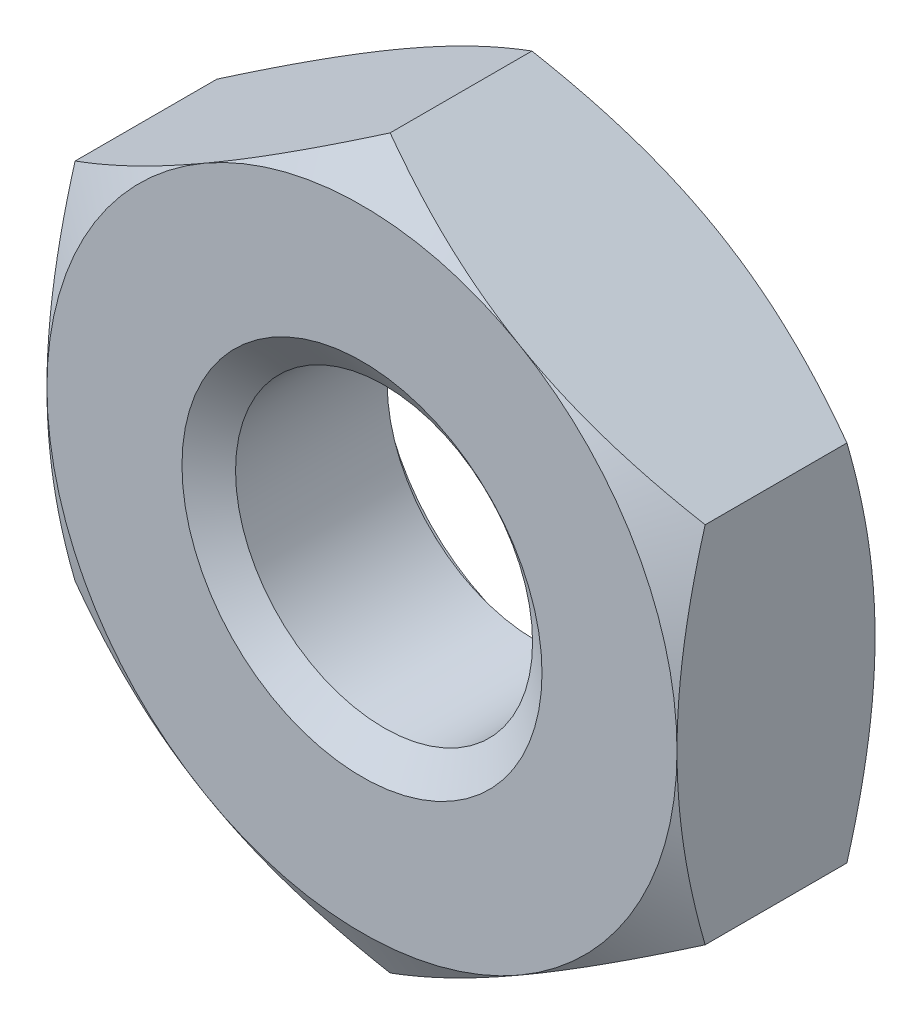
ISO-10303-21;
HEADER;
FILE_DESCRIPTION(('STEP AP214'),'2;1');
FILE_NAME('part.step','',(''),(''),'','','');
FILE_SCHEMA(('AUTOMOTIVE_DESIGN { 1 0 10303 214 1 1 1 1 }'));
ENDSEC;
DATA;
#1=APPLICATION_CONTEXT('core data for automotive mechanical design processes');
#2=APPLICATION_PROTOCOL_DEFINITION('international standard','automotive_design',2000,#1);
#3=PRODUCT_CONTEXT('',#1,'mechanical');
#4=PRODUCT('Part','Part','',(#3));
#5=PRODUCT_RELATED_PRODUCT_CATEGORY('part','',(#4));
#6=PRODUCT_DEFINITION_FORMATION('','',#4);
#7=PRODUCT_DEFINITION_CONTEXT('part definition',#1,'design');
#8=PRODUCT_DEFINITION('design','',#6,#7);
#9=PRODUCT_DEFINITION_SHAPE('','',#8);
#10=(LENGTH_UNIT() NAMED_UNIT(*) SI_UNIT(.MILLI.,.METRE.));
#11=(NAMED_UNIT(*) PLANE_ANGLE_UNIT() SI_UNIT($,.RADIAN.));
#12=(NAMED_UNIT(*) SI_UNIT($,.STERADIAN.) SOLID_ANGLE_UNIT());
#13=UNCERTAINTY_MEASURE_WITH_UNIT(LENGTH_MEASURE(1.E-05),#10,'distance_accuracy_value','');
#14=(GEOMETRIC_REPRESENTATION_CONTEXT(3) GLOBAL_UNCERTAINTY_ASSIGNED_CONTEXT((#13)) GLOBAL_UNIT_ASSIGNED_CONTEXT((#10,
#11,#12)) REPRESENTATION_CONTEXT('',''));
#15=CARTESIAN_POINT('',(0.,0.,0.));
#16=DIRECTION('',(0.,0.,1.));
#17=DIRECTION('',(1.,0.,0.));
#18=AXIS2_PLACEMENT_3D('',#15,#16,#17);
#19=CARTESIAN_POINT('',(0.,0.,-2.2));
#20=DIRECTION('',(0.,0.,1.));
#21=DIRECTION('',(1.,0.,0.));
#22=AXIS2_PLACEMENT_3D('',#19,#20,#21);
#23=CYLINDRICAL_SURFACE('',#22,1.65);
#24=CARTESIAN_POINT('',(0.,0.,-0.245072638373399));
#25=DIRECTION('',(0.,0.,1.));
#26=DIRECTION('',(1.,0.,0.));
#27=AXIS2_PLACEMENT_3D('',#24,#25,#26);
#28=CIRCLE('',#27,1.65);
#29=CARTESIAN_POINT('',(1.65,0.,-0.245072638373399));
#30=VERTEX_POINT('',#29);
#31=EDGE_CURVE('E176',#30,#30,#28,.F.);
#32=ORIENTED_EDGE('',*,*,#31,.F.);
#33=EDGE_LOOP('',(#32));
#34=FACE_BOUND('',#33,.T.);
#35=CARTESIAN_POINT('',(0.,0.,-1.9295273616266));
#36=DIRECTION('',(0.,0.,-1.));
#37=DIRECTION('',(-1.,0.,0.));
#38=AXIS2_PLACEMENT_3D('',#35,#36,#37);
#39=CIRCLE('',#38,1.65);
#40=CARTESIAN_POINT('',(-1.65,0.,-1.9295273616266));
#41=VERTEX_POINT('',#40);
#42=EDGE_CURVE('E41',#41,#41,#39,.F.);
#43=ORIENTED_EDGE('',*,*,#42,.F.);
#44=EDGE_LOOP('',(#43));
#45=FACE_BOUND('',#44,.T.);
#46=ADVANCED_FACE('F36',(#34,#45),#23,.F.);
#47=CARTESIAN_POINT('',(0.,4.04145188432738,-2.2));
#48=DIRECTION('',(0.,0.,-1.));
#49=DIRECTION('',(-1.,0.,0.));
#50=AXIS2_PLACEMENT_3D('',#47,#48,#49);
#51=PLANE('',#50);
#52=CARTESIAN_POINT('',(0.,0.,-2.2));
#53=DIRECTION('',(0.,0.,-1.));
#54=DIRECTION('',(-1.,0.,0.));
#55=AXIS2_PLACEMENT_3D('',#52,#53,#54);
#56=CIRCLE('',#55,3.5);
#57=CARTESIAN_POINT('',(-3.5,0.,-2.2));
#58=VERTEX_POINT('',#57);
#59=CARTESIAN_POINT('',(-1.75,-3.03108891324553,-2.2));
#60=VERTEX_POINT('',#59);
#61=EDGE_CURVE('E172',#58,#60,#56,.F.);
#62=ORIENTED_EDGE('',*,*,#61,.F.);
#63=CARTESIAN_POINT('',(-1.75,3.03108891324553,-2.2));
#64=VERTEX_POINT('',#63);
#65=EDGE_CURVE('E154',#64,#58,#56,.F.);
#66=ORIENTED_EDGE('',*,*,#65,.F.);
#67=CARTESIAN_POINT('',(1.75,3.03108891324553,-2.2));
#68=VERTEX_POINT('',#67);
#69=EDGE_CURVE('E171',#68,#64,#56,.F.);
#70=ORIENTED_EDGE('',*,*,#69,.F.);
#71=CARTESIAN_POINT('',(0.,0.,-2.2));
#72=DIRECTION('',(0.,0.,1.));
#73=DIRECTION('',(1.,0.,0.));
#74=AXIS2_PLACEMENT_3D('',#71,#72,#73);
#75=CIRCLE('',#74,3.5);
#76=CARTESIAN_POINT('',(3.5,0.,-2.2));
#77=VERTEX_POINT('',#76);
#78=EDGE_CURVE('E246',#77,#68,#75,.T.);
#79=ORIENTED_EDGE('',*,*,#78,.F.);
#80=CARTESIAN_POINT('',(1.75,-3.03108891324554,-2.2));
#81=VERTEX_POINT('',#80);
#82=EDGE_CURVE('E362',#81,#77,#56,.F.);
#83=ORIENTED_EDGE('',*,*,#82,.F.);
#84=EDGE_CURVE('E366',#60,#81,#56,.F.);
#85=ORIENTED_EDGE('',*,*,#84,.F.);
#86=EDGE_LOOP('',(#62,#66,#70,#79,#83,#85));
#87=FACE_BOUND('',#86,.T.);
#88=CARTESIAN_POINT('',(0.,0.,-2.2));
#89=DIRECTION('',(0.,0.,-1.));
#90=DIRECTION('',(-1.,0.,0.));
#91=AXIS2_PLACEMENT_3D('',#88,#89,#90);
#92=CIRCLE('',#91,2.);
#93=CARTESIAN_POINT('',(-2.,0.,-2.2));
#94=VERTEX_POINT('',#93);
#95=EDGE_CURVE('E179',#94,#94,#92,.F.);
#96=ORIENTED_EDGE('',*,*,#95,.T.);
#97=EDGE_LOOP('',(#96));
#98=FACE_BOUND('',#97,.T.);
#99=ADVANCED_FACE('F299',(#87,#98),#51,.T.);
#100=CARTESIAN_POINT('',(0.,4.04145188432738,0.));
#101=DIRECTION('',(0.,0.,-1.));
#102=DIRECTION('',(-1.,0.,0.));
#103=AXIS2_PLACEMENT_3D('',#100,#101,#102);
#104=PLANE('',#103);
#105=CARTESIAN_POINT('',(0.,0.,0.));
#106=DIRECTION('',(0.,0.,-1.));
#107=DIRECTION('',(-1.,0.,0.));
#108=AXIS2_PLACEMENT_3D('',#105,#106,#107);
#109=CIRCLE('',#108,3.5);
#110=CARTESIAN_POINT('',(-3.5,0.,0.));
#111=VERTEX_POINT('',#110);
#112=CARTESIAN_POINT('',(-1.75,3.03108891324553,0.));
#113=VERTEX_POINT('',#112);
#114=EDGE_CURVE('E11',#111,#113,#109,.T.);
#115=ORIENTED_EDGE('',*,*,#114,.F.);
#116=CARTESIAN_POINT('',(-1.75,-3.03108891324553,0.));
#117=VERTEX_POINT('',#116);
#118=EDGE_CURVE('E48',#117,#111,#109,.T.);
#119=ORIENTED_EDGE('',*,*,#118,.F.);
#120=CARTESIAN_POINT('',(1.75,-3.03108891324554,0.));
#121=VERTEX_POINT('',#120);
#122=EDGE_CURVE('E175',#121,#117,#109,.T.);
#123=ORIENTED_EDGE('',*,*,#122,.F.);
#124=CARTESIAN_POINT('',(3.5,0.,0.));
#125=VERTEX_POINT('',#124);
#126=EDGE_CURVE('E353',#125,#121,#109,.T.);
#127=ORIENTED_EDGE('',*,*,#126,.F.);
#128=CARTESIAN_POINT('',(0.,0.,0.));
#129=DIRECTION('',(0.,0.,1.));
#130=DIRECTION('',(1.,0.,0.));
#131=AXIS2_PLACEMENT_3D('',#128,#129,#130);
#132=CIRCLE('',#131,3.5);
#133=CARTESIAN_POINT('',(1.75,3.03108891324553,0.));
#134=VERTEX_POINT('',#133);
#135=EDGE_CURVE('E130',#125,#134,#132,.T.);
#136=ORIENTED_EDGE('',*,*,#135,.T.);
#137=EDGE_CURVE('E46',#113,#134,#109,.T.);
#138=ORIENTED_EDGE('',*,*,#137,.F.);
#139=EDGE_LOOP('',(#115,#119,#123,#127,#136,#138));
#140=FACE_BOUND('',#139,.T.);
#141=CARTESIAN_POINT('',(0.,0.,0.));
#142=DIRECTION('',(0.,0.,1.));
#143=DIRECTION('',(1.,0.,0.));
#144=AXIS2_PLACEMENT_3D('',#141,#142,#143);
#145=CIRCLE('',#144,2.);
#146=CARTESIAN_POINT('',(2.,0.,0.));
#147=VERTEX_POINT('',#146);
#148=EDGE_CURVE('E178',#147,#147,#145,.T.);
#149=ORIENTED_EDGE('',*,*,#148,.F.);
#150=EDGE_LOOP('',(#149));
#151=FACE_BOUND('',#150,.T.);
#152=ADVANCED_FACE('F251',(#140,#151),#104,.F.);
#153=CARTESIAN_POINT('',(0.,4.04145188432738,-2.2));
#154=DIRECTION('',(-0.5,0.866025403784438,0.));
#155=DIRECTION('',(-0.866025403784438,-0.5,0.));
#156=AXIS2_PLACEMENT_3D('',#153,#154,#155);
#157=PLANE('',#156);
#158=DIRECTION('',(0.,0.,1.));
#159=VECTOR('',#158,1.);
#160=CARTESIAN_POINT('',(-3.5,2.02072594216369,-2.2));
#161=LINE('',#160,#159);
#162=CARTESIAN_POINT('',(-3.5,2.02072594216369,-1.88739260883036));
#163=VERTEX_POINT('',#162);
#164=CARTESIAN_POINT('',(-3.5,2.02072594216369,-0.312607391169644));
#165=VERTEX_POINT('',#164);
#166=EDGE_CURVE('E166',#163,#165,#161,.T.);
#167=ORIENTED_EDGE('',*,*,#166,.T.);
#168=CARTESIAN_POINT('',(-3.5002,2.02061047210985,-0.312674060693372));
#169=CARTESIAN_POINT('',(-3.34639282154755,2.10941108799267,-0.261385788989984));
#170=CARTESIAN_POINT('',(-3.19125798916558,2.19897822522909,-0.214740953816197));
#171=CARTESIAN_POINT('',(-2.87830199342322,2.37966345361545,-0.133321875533348));
#172=CARTESIAN_POINT('',(-2.7204752692125,2.47078475532382,-0.0985764355845611));
#173=CARTESIAN_POINT('',(-2.40677778961987,2.65189807961073,-0.0444900271828356));
#174=CARTESIAN_POINT('',(-2.25095530083931,2.74186223545399,-0.0247890862603809));
#175=CARTESIAN_POINT('',(-1.93857711279463,2.92221386641056,-0.0012701327372537));
#176=CARTESIAN_POINT('',(-1.78202254896577,3.01260068598001,0.00256735545443533));
#177=CARTESIAN_POINT('',(-1.48949078007901,3.1814939814933,-0.00541530187697737));
#178=CARTESIAN_POINT('',(-1.35346978754209,3.26002573814993,-0.015275434069607));
#179=CARTESIAN_POINT('',(-1.082313979711,3.41657761679354,-0.0465264668994037));
#180=CARTESIAN_POINT('',(-0.947180102315317,3.49459719728458,-0.0679280432857986));
#181=CARTESIAN_POINT('',(-0.675465207594816,3.65147186489429,-0.121430407880578));
#182=CARTESIAN_POINT('',(-0.538918580721664,3.73030709667644,-0.153757994445088));
#183=CARTESIAN_POINT('',(-0.267861907055498,3.88680174018324,-0.227128933807995));
#184=CARTESIAN_POINT('',(-0.133348387531463,3.96446315689009,-0.268155046569868));
#185=CARTESIAN_POINT('',(0.000200000000000118,4.04156735438122,-0.312674060693372));
#186=B_SPLINE_CURVE_WITH_KNOTS('',3,(#168,#169,#170,#171,#172,#173,#174,#175,#176,#177,#178,
#179,#180,#181,#182,#183,#184,#185),.UNSPECIFIED.,.F.,.F.,(4,2,2,2,2,2,2,2,4),(0.,
0.554793832886254,1.11092123814984,1.65328467083219,2.19498204478403,2.6666513085086,
3.13875761298267,3.6213361260051,4.10296698719187),.UNSPECIFIED.);
#187=EDGE_CURVE('E135',#165,#113,#186,.T.);
#188=ORIENTED_EDGE('',*,*,#187,.T.);
#189=CARTESIAN_POINT('',(0.,4.04145188432738,-0.312607391169645));
#190=VERTEX_POINT('',#189);
#191=EDGE_CURVE('E55',#113,#190,#186,.T.);
#192=ORIENTED_EDGE('',*,*,#191,.T.);
#193=DIRECTION('',(0.,0.,1.));
#194=VECTOR('',#193,1.);
#195=CARTESIAN_POINT('',(0.,4.04145188432738,-2.2));
#196=LINE('',#195,#194);
#197=CARTESIAN_POINT('',(0.,4.04145188432738,-1.88739260883036));
#198=VERTEX_POINT('',#197);
#199=EDGE_CURVE('E151',#198,#190,#196,.T.);
#200=ORIENTED_EDGE('',*,*,#199,.F.);
#201=CARTESIAN_POINT('',(-3.5002,2.02061047210985,-1.88732593930663));
#202=CARTESIAN_POINT('',(-3.34639282154755,2.10941108799267,-1.93861421101002));
#203=CARTESIAN_POINT('',(-3.19125798916558,2.19897822522909,-1.9852590461838));
#204=CARTESIAN_POINT('',(-2.87830199342322,2.37966345361545,-2.06667812446665));
#205=CARTESIAN_POINT('',(-2.7204752692125,2.47078475532382,-2.10142356441544));
#206=CARTESIAN_POINT('',(-2.40677778961987,2.65189807961073,-2.15550997281716));
#207=CARTESIAN_POINT('',(-2.25095530083931,2.74186223545399,-2.17521091373962));
#208=CARTESIAN_POINT('',(-1.93857711279463,2.92221386641056,-2.19872986726275));
#209=CARTESIAN_POINT('',(-1.78202254896577,3.01260068598001,-2.20256735545444));
#210=CARTESIAN_POINT('',(-1.48949078007901,3.1814939814933,-2.19458469812302));
#211=CARTESIAN_POINT('',(-1.35346978754209,3.26002573814993,-2.18472456593039));
#212=CARTESIAN_POINT('',(-1.082313979711,3.41657761679354,-2.1534735331006));
#213=CARTESIAN_POINT('',(-0.947180102315317,3.49459719728458,-2.1320719567142));
#214=CARTESIAN_POINT('',(-0.675465207594816,3.65147186489429,-2.07856959211942));
#215=CARTESIAN_POINT('',(-0.538918580721664,3.73030709667644,-2.04624200555491));
#216=CARTESIAN_POINT('',(-0.267861907055498,3.88680174018324,-1.972871066192));
#217=CARTESIAN_POINT('',(-0.133348387531463,3.96446315689009,-1.93184495343013));
#218=CARTESIAN_POINT('',(0.000200000000000115,4.04156735438122,-1.88732593930663));
#219=B_SPLINE_CURVE_WITH_KNOTS('',3,(#201,#202,#203,#204,#205,#206,#207,#208,#209,#210,#211,
#212,#213,#214,#215,#216,#217,#218),.UNSPECIFIED.,.F.,.F.,(4,2,2,2,2,2,2,2,4),(0.,
0.554793832886254,1.11092123814984,1.65328467083219,2.19498204478403,2.6666513085086,
3.13875761298267,3.6213361260051,4.10296698719187),.UNSPECIFIED.);
#220=EDGE_CURVE('E169',#64,#198,#219,.T.);
#221=ORIENTED_EDGE('',*,*,#220,.F.);
#222=EDGE_CURVE('E261',#163,#64,#219,.T.);
#223=ORIENTED_EDGE('',*,*,#222,.F.);
#224=EDGE_LOOP('',(#167,#188,#192,#200,#221,#223));
#225=FACE_BOUND('',#224,.T.);
#226=ADVANCED_FACE('F38',(#225),#157,.T.);
#227=CARTESIAN_POINT('',(3.5,2.02072594216369,-2.2));
#228=DIRECTION('',(0.500000000000001,0.866025403784438,0.));
#229=DIRECTION('',(-0.866025403784438,0.500000000000001,0.));
#230=AXIS2_PLACEMENT_3D('',#227,#228,#229);
#231=PLANE('',#230);
#232=ORIENTED_EDGE('',*,*,#199,.T.);
#233=CARTESIAN_POINT('',(-0.000199999999999875,4.04156735438122,-0.312674060693373));
#234=CARTESIAN_POINT('',(0.153607178452449,3.9527667384984,-0.261385788989985));
#235=CARTESIAN_POINT('',(0.308742010834424,3.86319960126198,-0.214740953816198));
#236=CARTESIAN_POINT('',(0.621698006576782,3.68251437287562,-0.133321875533349));
#237=CARTESIAN_POINT('',(0.779524730787497,3.59139307116725,-0.0985764355845618));
#238=CARTESIAN_POINT('',(1.09322221038013,3.41027974688034,-0.044490027182836));
#239=CARTESIAN_POINT('',(1.24904469916069,3.32031559103708,-0.0247890862603812));
#240=CARTESIAN_POINT('',(1.56142288720538,3.13996396008051,-0.00127013273725366));
#241=CARTESIAN_POINT('',(1.71797745103423,3.04957714051106,0.00256735545443548));
#242=CARTESIAN_POINT('',(2.01050921992099,2.88068384499777,-0.00541530187697702));
#243=CARTESIAN_POINT('',(2.14653021245791,2.80215208834114,-0.0152754340696065));
#244=CARTESIAN_POINT('',(2.417686020289,2.64560020969753,-0.046526466899403));
#245=CARTESIAN_POINT('',(2.55281989768468,2.56758062920649,-0.0679280432857976));
#246=CARTESIAN_POINT('',(2.82453479240518,2.41070596159678,-0.121430407880577));
#247=CARTESIAN_POINT('',(2.96108141927834,2.33187072981463,-0.153757994445087));
#248=CARTESIAN_POINT('',(3.2321380929445,2.17537608630783,-0.227128933807994));
#249=CARTESIAN_POINT('',(3.36665161246854,2.09771466960098,-0.268155046569867));
#250=CARTESIAN_POINT('',(3.5002,2.02061047210985,-0.312674060693371));
#251=B_SPLINE_CURVE_WITH_KNOTS('',3,(#233,#234,#235,#236,#237,#238,#239,#240,#241,#242,#243,
#244,#245,#246,#247,#248,#249,#250),.UNSPECIFIED.,.F.,.F.,(4,2,2,2,2,2,2,2,4),(0.,
0.554793832886254,1.11092123814984,1.65328467083219,2.19498204478403,2.6666513085086,
3.13875761298267,3.6213361260051,4.10296698719187),.UNSPECIFIED.);
#252=EDGE_CURVE('E145',#190,#134,#251,.T.);
#253=ORIENTED_EDGE('',*,*,#252,.T.);
#254=CARTESIAN_POINT('',(3.5,2.02072594216369,-0.312607391169645));
#255=VERTEX_POINT('',#254);
#256=EDGE_CURVE('E62',#134,#255,#251,.T.);
#257=ORIENTED_EDGE('',*,*,#256,.T.);
#258=DIRECTION('',(0.,0.,1.));
#259=VECTOR('',#258,1.);
#260=CARTESIAN_POINT('',(3.5,2.02072594216369,-2.2));
#261=LINE('',#260,#259);
#262=CARTESIAN_POINT('',(3.5,2.02072594216369,-1.88739260883036));
#263=VERTEX_POINT('',#262);
#264=EDGE_CURVE('E144',#263,#255,#261,.T.);
#265=ORIENTED_EDGE('',*,*,#264,.F.);
#266=CARTESIAN_POINT('',(-0.000199999999999904,4.04156735438122,-1.88732593930663));
#267=CARTESIAN_POINT('',(0.15360717845245,3.9527667384984,-1.93861421101002));
#268=CARTESIAN_POINT('',(0.308742010834424,3.86319960126198,-1.9852590461838));
#269=CARTESIAN_POINT('',(0.621698006576782,3.68251437287562,-2.06667812446665));
#270=CARTESIAN_POINT('',(0.779524730787497,3.59139307116725,-2.10142356441544));
#271=CARTESIAN_POINT('',(1.09322221038013,3.41027974688034,-2.15550997281716));
#272=CARTESIAN_POINT('',(1.24904469916069,3.32031559103708,-2.17521091373962));
#273=CARTESIAN_POINT('',(1.56142288720538,3.13996396008051,-2.19872986726275));
#274=CARTESIAN_POINT('',(1.71797745103423,3.04957714051106,-2.20256735545444));
#275=CARTESIAN_POINT('',(2.01050921992099,2.88068384499777,-2.19458469812302));
#276=CARTESIAN_POINT('',(2.14653021245791,2.80215208834114,-2.18472456593039));
#277=CARTESIAN_POINT('',(2.417686020289,2.64560020969753,-2.1534735331006));
#278=CARTESIAN_POINT('',(2.55281989768468,2.56758062920649,-2.1320719567142));
#279=CARTESIAN_POINT('',(2.82453479240518,2.41070596159678,-2.07856959211942));
#280=CARTESIAN_POINT('',(2.96108141927834,2.33187072981463,-2.04624200555491));
#281=CARTESIAN_POINT('',(3.2321380929445,2.17537608630783,-1.97287106619201));
#282=CARTESIAN_POINT('',(3.36665161246854,2.09771466960098,-1.93184495343013));
#283=CARTESIAN_POINT('',(3.5002,2.02061047210985,-1.88732593930663));
#284=B_SPLINE_CURVE_WITH_KNOTS('',3,(#266,#267,#268,#269,#270,#271,#272,#273,#274,#275,#276,
#277,#278,#279,#280,#281,#282,#283),.UNSPECIFIED.,.F.,.F.,(4,2,2,2,2,2,2,2,4),(0.,
0.554793832886254,1.11092123814984,1.65328467083219,2.19498204478403,2.6666513085086,
3.13875761298267,3.6213361260051,4.10296698719187),.UNSPECIFIED.);
#285=EDGE_CURVE('E255',#68,#263,#284,.T.);
#286=ORIENTED_EDGE('',*,*,#285,.F.);
#287=EDGE_CURVE('E260',#198,#68,#284,.T.);
#288=ORIENTED_EDGE('',*,*,#287,.F.);
#289=EDGE_LOOP('',(#232,#253,#257,#265,#286,#288));
#290=FACE_BOUND('',#289,.T.);
#291=ADVANCED_FACE('F142',(#290),#231,.T.);
#292=CARTESIAN_POINT('',(3.5,2.02072594216369,-2.2));
#293=DIRECTION('',(-1.,0.,0.));
#294=DIRECTION('',(0.,0.,1.));
#295=AXIS2_PLACEMENT_3D('',#292,#293,#294);
#296=PLANE('',#295);
#297=CARTESIAN_POINT('',(3.5,-5.35926299121406,-1.67484346858556));
#298=CARTESIAN_POINT('',(3.5,-5.20559319908842,-1.60058173692104));
#299=CARTESIAN_POINT('',(3.5,-5.05156008083375,-1.52705822833147));
#300=CARTESIAN_POINT('',(3.5,-4.7425707418071,-1.38190950344752));
#301=CARTESIAN_POINT('',(3.5,-4.58761436682437,-1.31028461582133));
#302=CARTESIAN_POINT('',(3.5,-4.27574500225542,-1.16897765517624));
#303=CARTESIAN_POINT('',(3.5,-4.11882589028192,-1.09930904568016));
#304=CARTESIAN_POINT('',(3.5,-3.80369792903855,-0.962964262242761));
#305=CARTESIAN_POINT('',(3.5,-3.64548914750595,-0.896287932319519));
#306=CARTESIAN_POINT('',(3.5,-3.32556618401855,-0.765931819095067));
#307=CARTESIAN_POINT('',(3.5,-3.16383281219924,-0.702298873688865));
#308=CARTESIAN_POINT('',(3.5,-2.83845840945597,-0.580016702089492));
#309=CARTESIAN_POINT('',(3.5,-2.67481716858826,-0.521368030370691));
#310=CARTESIAN_POINT('',(3.5,-2.34570278472049,-0.410630279877022));
#311=CARTESIAN_POINT('',(3.5,-2.18023438248742,-0.358527255435858));
#312=CARTESIAN_POINT('',(3.5,-1.8469452280637,-0.262572936976443));
#313=CARTESIAN_POINT('',(3.5,-1.6791252378753,-0.218719033467158));
#314=CARTESIAN_POINT('',(3.5,-1.34101828610925,-0.141391945584787));
#315=CARTESIAN_POINT('',(3.5,-1.17073068027693,-0.107921525211972));
#316=CARTESIAN_POINT('',(3.5,-0.828102385138484,-0.0536149564320501));
#317=CARTESIAN_POINT('',(3.5,-0.655761694017302,-0.0327788191952361));
#318=CARTESIAN_POINT('',(3.5,-0.311020490924449,-0.00558408650575648));
#319=CARTESIAN_POINT('',(3.5,-0.138627397207259,0.000866163165911341));
#320=CARTESIAN_POINT('',(3.5,0.206038074906535,-0.00105355807794618));
#321=CARTESIAN_POINT('',(3.5,0.37831047302318,-0.00941968196343199));
#322=CARTESIAN_POINT('',(3.5,0.672490555822328,-0.0357688927868921));
#323=CARTESIAN_POINT('',(3.5,0.794722791084092,-0.0503206340384214));
#324=CARTESIAN_POINT('',(3.5,1.0382430543056,-0.0859367340533558));
#325=CARTESIAN_POINT('',(3.5,1.15953093025887,-0.107002119926141));
#326=CARTESIAN_POINT('',(3.5,1.52187914771348,-0.178863187081452));
#327=CARTESIAN_POINT('',(3.5,1.76124104212632,-0.23830527562201));
#328=CARTESIAN_POINT('',(3.5,2.11940971387708,-0.340826814402554));
#329=CARTESIAN_POINT('',(3.5,2.24008344316346,-0.377749699085183));
#330=CARTESIAN_POINT('',(3.5,2.48017139213728,-0.455249007699293));
#331=CARTESIAN_POINT('',(3.5,2.59958641795613,-0.49582291166355));
#332=CARTESIAN_POINT('',(3.5,2.83665760451798,-0.579779986782752));
#333=CARTESIAN_POINT('',(3.5,2.95431988203484,-0.623146060034314));
#334=CARTESIAN_POINT('',(3.5,3.188731535088,-0.712423559566866));
#335=CARTESIAN_POINT('',(3.5,3.30548051959464,-0.75833601459295));
#336=CARTESIAN_POINT('',(3.5,3.42180736613349,-0.80527038072407));
#337=B_SPLINE_CURVE_WITH_KNOTS('',3,(#297,#298,#299,#300,#301,#302,#303,#304,#305,#306,#307,
#308,#309,#310,#311,#312,#313,#314,#315,#316,#317,#318,#319,#320,#321,#322,#323,#324,#325,#326,
#327,#328,#329,#330,#331,#332,#333,#334,#335,#336),.UNSPECIFIED.,.F.,.F.,(4,2,2,2,2,2,2,2,2,2,2,
2,2,2,2,2,2,2,2,4),(0.,0.512025318465737,1.02413870177436,1.53918270315241,2.05419982499223,
2.57553975872798,3.09693761309353,3.617205066104,4.13730766217537,4.65754858684364,
5.17778997146961,5.69470725122282,6.21149033452401,6.58059623222331,6.94976036239485,
7.68863804939851,8.06719621660478,8.4454950747676,8.82166461280099,9.1979872473341),.UNSPECIFIED.);
#338=CARTESIAN_POINT('',(3.5,-2.02072594216369,-0.312607391169645));
#339=VERTEX_POINT('',#338);
#340=EDGE_CURVE('E137',#339,#125,#337,.T.);
#341=ORIENTED_EDGE('',*,*,#340,.F.);
#342=DIRECTION('',(0.,0.,1.));
#343=VECTOR('',#342,1.);
#344=CARTESIAN_POINT('',(3.5,-2.02072594216369,-2.2));
#345=LINE('',#344,#343);
#346=CARTESIAN_POINT('',(3.5,-2.02072594216369,-1.88739260883036));
#347=VERTEX_POINT('',#346);
#348=EDGE_CURVE('E152',#347,#339,#345,.T.);
#349=ORIENTED_EDGE('',*,*,#348,.F.);
#350=CARTESIAN_POINT('',(3.5,-5.35926299121406,-0.525156531414439));
#351=CARTESIAN_POINT('',(3.5,-5.20559319908842,-0.599418263078963));
#352=CARTESIAN_POINT('',(3.5,-5.05156008083375,-0.672941771668526));
#353=CARTESIAN_POINT('',(3.5,-4.7425707418071,-0.818090496552481));
#354=CARTESIAN_POINT('',(3.5,-4.58761436682437,-0.889715384178672));
#355=CARTESIAN_POINT('',(3.5,-4.27574500225542,-1.03102234482376));
#356=CARTESIAN_POINT('',(3.5,-4.11882589028192,-1.10069095431984));
#357=CARTESIAN_POINT('',(3.5,-3.80369792903855,-1.23703573775724));
#358=CARTESIAN_POINT('',(3.5,-3.64548914750595,-1.30371206768048));
#359=CARTESIAN_POINT('',(3.5,-3.32556618401855,-1.43406818090493));
#360=CARTESIAN_POINT('',(3.5,-3.16383281219924,-1.49770112631114));
#361=CARTESIAN_POINT('',(3.5,-2.83845840945597,-1.61998329791051));
#362=CARTESIAN_POINT('',(3.5,-2.67481716858826,-1.67863196962931));
#363=CARTESIAN_POINT('',(3.5,-2.34570278472049,-1.78936972012298));
#364=CARTESIAN_POINT('',(3.5,-2.18023438248742,-1.84147274456414));
#365=CARTESIAN_POINT('',(3.5,-1.8469452280637,-1.93742706302356));
#366=CARTESIAN_POINT('',(3.5,-1.6791252378753,-1.98128096653284));
#367=CARTESIAN_POINT('',(3.5,-1.34101828610925,-2.05860805441521));
#368=CARTESIAN_POINT('',(3.5,-1.17073068027693,-2.09207847478803));
#369=CARTESIAN_POINT('',(3.5,-0.828102385138484,-2.14638504356795));
#370=CARTESIAN_POINT('',(3.5,-0.655761694017302,-2.16722118080476));
#371=CARTESIAN_POINT('',(3.5,-0.311020490924449,-2.19441591349424));
#372=CARTESIAN_POINT('',(3.5,-0.138627397207259,-2.20086616316591));
#373=CARTESIAN_POINT('',(3.5,0.206038074906535,-2.19894644192205));
#374=CARTESIAN_POINT('',(3.5,0.37831047302318,-2.19058031803657));
#375=CARTESIAN_POINT('',(3.5,0.672490555822328,-2.16423110721311));
#376=CARTESIAN_POINT('',(3.5,0.794722791084092,-2.14967936596158));
#377=CARTESIAN_POINT('',(3.5,1.0382430543056,-2.11406326594664));
#378=CARTESIAN_POINT('',(3.5,1.15953093025887,-2.09299788007386));
#379=CARTESIAN_POINT('',(3.5,1.52187914771348,-2.02113681291855));
#380=CARTESIAN_POINT('',(3.5,1.76124104212632,-1.96169472437799));
#381=CARTESIAN_POINT('',(3.5,2.11940971387708,-1.85917318559745));
#382=CARTESIAN_POINT('',(3.5,2.24008344316346,-1.82225030091482));
#383=CARTESIAN_POINT('',(3.5,2.48017139213728,-1.74475099230071));
#384=CARTESIAN_POINT('',(3.5,2.59958641795613,-1.70417708833645));
#385=CARTESIAN_POINT('',(3.5,2.83665760451798,-1.62022001321725));
#386=CARTESIAN_POINT('',(3.5,2.95431988203484,-1.57685393996569));
#387=CARTESIAN_POINT('',(3.5,3.188731535088,-1.48757644043313));
#388=CARTESIAN_POINT('',(3.5,3.30548051959464,-1.44166398540705));
#389=CARTESIAN_POINT('',(3.5,3.42180736613349,-1.39472961927593));
#390=B_SPLINE_CURVE_WITH_KNOTS('',3,(#350,#351,#352,#353,#354,#355,#356,#357,#358,#359,#360,
#361,#362,#363,#364,#365,#366,#367,#368,#369,#370,#371,#372,#373,#374,#375,#376,#377,#378,#379,
#380,#381,#382,#383,#384,#385,#386,#387,#388,#389),.UNSPECIFIED.,.F.,.F.,(4,2,2,2,2,2,2,2,2,2,2,
2,2,2,2,2,2,2,2,4),(0.,0.512025318465737,1.02413870177436,1.53918270315241,2.05419982499223,
2.57553975872798,3.09693761309353,3.617205066104,4.13730766217537,4.65754858684364,
5.17778997146961,5.69470725122282,6.21149033452401,6.58059623222331,6.94976036239485,
7.68863804939851,8.06719621660478,8.4454950747676,8.82166461280099,9.1979872473341),.UNSPECIFIED.);
#391=EDGE_CURVE('E267',#347,#77,#390,.T.);
#392=ORIENTED_EDGE('',*,*,#391,.T.);
#393=EDGE_CURVE('E150',#77,#263,#390,.T.);
#394=ORIENTED_EDGE('',*,*,#393,.T.);
#395=ORIENTED_EDGE('',*,*,#264,.T.);
#396=EDGE_CURVE('E127',#125,#255,#337,.T.);
#397=ORIENTED_EDGE('',*,*,#396,.F.);
#398=EDGE_LOOP('',(#341,#349,#392,#394,#395,#397));
#399=FACE_BOUND('',#398,.T.);
#400=ADVANCED_FACE('F148',(#399),#296,.F.);
#401=CARTESIAN_POINT('',(0.,-4.04145188432739,-2.2));
#402=DIRECTION('',(0.5,-0.866025403784438,0.));
#403=DIRECTION('',(0.866025403784439,0.5,0.));
#404=AXIS2_PLACEMENT_3D('',#401,#402,#403);
#405=PLANE('',#404);
#406=ORIENTED_EDGE('',*,*,#348,.T.);
#407=CARTESIAN_POINT('',(3.5002,-2.02061047210986,-0.312674060693373));
#408=CARTESIAN_POINT('',(3.34639282154755,-2.10941108799267,-0.261385788989985));
#409=CARTESIAN_POINT('',(3.19125798916558,-2.1989782252291,-0.214740953816198));
#410=CARTESIAN_POINT('',(2.87830199342322,-2.37966345361545,-0.13332187553335));
#411=CARTESIAN_POINT('',(2.7204752692125,-2.47078475532383,-0.0985764355845624));
#412=CARTESIAN_POINT('',(2.40677778961987,-2.65189807961074,-0.0444900271828371));
#413=CARTESIAN_POINT('',(2.25095530083931,-2.741862235454,-0.0247890862603825));
#414=CARTESIAN_POINT('',(1.93857711279462,-2.92221386641056,-0.00127013273725558));
#415=CARTESIAN_POINT('',(1.78202254896577,-3.01260068598002,0.00256735545443329));
#416=CARTESIAN_POINT('',(1.48949078007901,-3.1814939814933,-0.00541530187697968));
#417=CARTESIAN_POINT('',(1.35346978754209,-3.26002573814993,-0.0152754340696093));
#418=CARTESIAN_POINT('',(1.082313979711,-3.41657761679354,-0.0465264668994059));
#419=CARTESIAN_POINT('',(0.947180102315316,-3.49459719728458,-0.0679280432858007));
#420=CARTESIAN_POINT('',(0.675465207594815,-3.65147186489429,-0.12143040788058));
#421=CARTESIAN_POINT('',(0.538918580721663,-3.73030709667644,-0.15375799444509));
#422=CARTESIAN_POINT('',(0.267861907055498,-3.88680174018325,-0.227128933807997));
#423=CARTESIAN_POINT('',(0.133348387531463,-3.96446315689009,-0.26815504656987));
#424=CARTESIAN_POINT('',(-0.000200000000000296,-4.04156735438122,-0.312674060693374));
#425=B_SPLINE_CURVE_WITH_KNOTS('',3,(#407,#408,#409,#410,#411,#412,#413,#414,#415,#416,#417,
#418,#419,#420,#421,#422,#423,#424),.UNSPECIFIED.,.F.,.F.,(4,2,2,2,2,2,2,2,4),(0.,
0.554793832886254,1.11092123814984,1.65328467083219,2.19498204478403,2.6666513085086,
3.13875761298267,3.6213361260051,4.10296698719187),.UNSPECIFIED.);
#426=EDGE_CURVE('E348',#339,#121,#425,.T.);
#427=ORIENTED_EDGE('',*,*,#426,.T.);
#428=CARTESIAN_POINT('',(0.,-4.04145188432738,-0.312607391169645));
#429=VERTEX_POINT('',#428);
#430=EDGE_CURVE('E227',#121,#429,#425,.T.);
#431=ORIENTED_EDGE('',*,*,#430,.T.);
#432=DIRECTION('',(0.,0.,1.));
#433=VECTOR('',#432,1.);
#434=CARTESIAN_POINT('',(0.,-4.04145188432739,-2.2));
#435=LINE('',#434,#433);
#436=CARTESIAN_POINT('',(0.,-4.04145188432738,-1.88739260883036));
#437=VERTEX_POINT('',#436);
#438=EDGE_CURVE('E157',#437,#429,#435,.T.);
#439=ORIENTED_EDGE('',*,*,#438,.F.);
#440=CARTESIAN_POINT('',(3.5002,-2.02061047210986,-1.88732593930663));
#441=CARTESIAN_POINT('',(3.34639282154755,-2.10941108799267,-1.93861421101002));
#442=CARTESIAN_POINT('',(3.19125798916558,-2.1989782252291,-1.9852590461838));
#443=CARTESIAN_POINT('',(2.87830199342322,-2.37966345361545,-2.06667812446665));
#444=CARTESIAN_POINT('',(2.7204752692125,-2.47078475532383,-2.10142356441544));
#445=CARTESIAN_POINT('',(2.40677778961987,-2.65189807961074,-2.15550997281716));
#446=CARTESIAN_POINT('',(2.25095530083931,-2.741862235454,-2.17521091373962));
#447=CARTESIAN_POINT('',(1.93857711279462,-2.92221386641056,-2.19872986726274));
#448=CARTESIAN_POINT('',(1.78202254896577,-3.01260068598002,-2.20256735545443));
#449=CARTESIAN_POINT('',(1.48949078007901,-3.1814939814933,-2.19458469812302));
#450=CARTESIAN_POINT('',(1.35346978754209,-3.26002573814993,-2.18472456593039));
#451=CARTESIAN_POINT('',(1.082313979711,-3.41657761679354,-2.15347353310059));
#452=CARTESIAN_POINT('',(0.947180102315316,-3.49459719728458,-2.1320719567142));
#453=CARTESIAN_POINT('',(0.675465207594815,-3.65147186489429,-2.07856959211942));
#454=CARTESIAN_POINT('',(0.538918580721663,-3.73030709667644,-2.04624200555491));
#455=CARTESIAN_POINT('',(0.267861907055498,-3.88680174018325,-1.972871066192));
#456=CARTESIAN_POINT('',(0.133348387531463,-3.96446315689009,-1.93184495343013));
#457=CARTESIAN_POINT('',(-0.000200000000000292,-4.04156735438122,-1.88732593930663));
#458=B_SPLINE_CURVE_WITH_KNOTS('',3,(#440,#441,#442,#443,#444,#445,#446,#447,#448,#449,#450,
#451,#452,#453,#454,#455,#456,#457),.UNSPECIFIED.,.F.,.F.,(4,2,2,2,2,2,2,2,4),(0.,
0.554793832886254,1.11092123814984,1.65328467083219,2.19498204478403,2.6666513085086,
3.13875761298267,3.6213361260051,4.10296698719187),.UNSPECIFIED.);
#459=EDGE_CURVE('E273',#81,#437,#458,.T.);
#460=ORIENTED_EDGE('',*,*,#459,.F.);
#461=EDGE_CURVE('E272',#347,#81,#458,.T.);
#462=ORIENTED_EDGE('',*,*,#461,.F.);
#463=EDGE_LOOP('',(#406,#427,#431,#439,#460,#462));
#464=FACE_BOUND('',#463,.T.);
#465=ADVANCED_FACE('F283',(#464),#405,.T.);
#466=CARTESIAN_POINT('',(-3.5,-2.02072594216369,-2.2));
#467=DIRECTION('',(-0.500000000000001,-0.866025403784438,0.));
#468=DIRECTION('',(0.866025403784438,-0.500000000000001,0.));
#469=AXIS2_PLACEMENT_3D('',#466,#467,#468);
#470=PLANE('',#469);
#471=ORIENTED_EDGE('',*,*,#438,.T.);
#472=CARTESIAN_POINT('',(0.00019999999999975,-4.04156735438122,-0.312674060693375));
#473=CARTESIAN_POINT('',(-0.15360717845245,-3.9527667384984,-0.261385788989986));
#474=CARTESIAN_POINT('',(-0.308742010834425,-3.86319960126198,-0.2147409538162));
#475=CARTESIAN_POINT('',(-0.621698006576782,-3.68251437287563,-0.133321875533351));
#476=CARTESIAN_POINT('',(-0.779524730787497,-3.59139307116725,-0.0985764355845636));
#477=CARTESIAN_POINT('',(-1.09322221038013,-3.41027974688034,-0.0444900271828379));
#478=CARTESIAN_POINT('',(-1.24904469916069,-3.32031559103708,-0.0247890862603831));
#479=CARTESIAN_POINT('',(-1.56142288720538,-3.13996396008052,-0.00127013273725572));
#480=CARTESIAN_POINT('',(-1.71797745103423,-3.04957714051106,0.00256735545443335));
#481=CARTESIAN_POINT('',(-2.01050921992099,-2.88068384499777,-0.00541530187697914));
#482=CARTESIAN_POINT('',(-2.14653021245791,-2.80215208834115,-0.0152754340696085));
#483=CARTESIAN_POINT('',(-2.417686020289,-2.64560020969754,-0.0465264668994049));
#484=CARTESIAN_POINT('',(-2.55281989768468,-2.5675806292065,-0.0679280432857995));
#485=CARTESIAN_POINT('',(-2.82453479240519,-2.41070596159679,-0.121430407880578));
#486=CARTESIAN_POINT('',(-2.96108141927834,-2.33187072981464,-0.153757994445088));
#487=CARTESIAN_POINT('',(-3.2321380929445,-2.17537608630783,-0.227128933807996));
#488=CARTESIAN_POINT('',(-3.36665161246854,-2.09771466960098,-0.268155046569868));
#489=CARTESIAN_POINT('',(-3.5002,-2.02061047210985,-0.312674060693372));
#490=B_SPLINE_CURVE_WITH_KNOTS('',3,(#472,#473,#474,#475,#476,#477,#478,#479,#480,#481,#482,
#483,#484,#485,#486,#487,#488,#489),.UNSPECIFIED.,.F.,.F.,(4,2,2,2,2,2,2,2,4),(0.,
0.554793832886255,1.11092123814984,1.65328467083219,2.19498204478404,2.6666513085086,
3.13875761298268,3.6213361260051,4.10296698719187),.UNSPECIFIED.);
#491=EDGE_CURVE('E346',#429,#117,#490,.T.);
#492=ORIENTED_EDGE('',*,*,#491,.T.);
#493=CARTESIAN_POINT('',(-3.5,-2.02072594216369,-0.312607391169645));
#494=VERTEX_POINT('',#493);
#495=EDGE_CURVE('E201',#117,#494,#490,.T.);
#496=ORIENTED_EDGE('',*,*,#495,.T.);
#497=DIRECTION('',(0.,0.,1.));
#498=VECTOR('',#497,1.);
#499=CARTESIAN_POINT('',(-3.5,-2.02072594216369,-2.2));
#500=LINE('',#499,#498);
#501=CARTESIAN_POINT('',(-3.5,-2.02072594216369,-1.88739260883036));
#502=VERTEX_POINT('',#501);
#503=EDGE_CURVE('E163',#502,#494,#500,.T.);
#504=ORIENTED_EDGE('',*,*,#503,.F.);
#505=CARTESIAN_POINT('',(0.00019999999999975,-4.04156735438122,-1.88732593930663));
#506=CARTESIAN_POINT('',(-0.15360717845245,-3.9527667384984,-1.93861421101001));
#507=CARTESIAN_POINT('',(-0.308742010834424,-3.86319960126198,-1.9852590461838));
#508=CARTESIAN_POINT('',(-0.621698006576782,-3.68251437287563,-2.06667812446665));
#509=CARTESIAN_POINT('',(-0.779524730787497,-3.59139307116725,-2.10142356441544));
#510=CARTESIAN_POINT('',(-1.09322221038013,-3.41027974688034,-2.15550997281716));
#511=CARTESIAN_POINT('',(-1.24904469916069,-3.32031559103708,-2.17521091373962));
#512=CARTESIAN_POINT('',(-1.56142288720538,-3.13996396008052,-2.19872986726274));
#513=CARTESIAN_POINT('',(-1.71797745103423,-3.04957714051106,-2.20256735545443));
#514=CARTESIAN_POINT('',(-2.01050921992099,-2.88068384499777,-2.19458469812302));
#515=CARTESIAN_POINT('',(-2.14653021245791,-2.80215208834115,-2.18472456593039));
#516=CARTESIAN_POINT('',(-2.417686020289,-2.64560020969754,-2.1534735331006));
#517=CARTESIAN_POINT('',(-2.55281989768468,-2.5675806292065,-2.1320719567142));
#518=CARTESIAN_POINT('',(-2.82453479240518,-2.41070596159679,-2.07856959211942));
#519=CARTESIAN_POINT('',(-2.96108141927834,-2.33187072981464,-2.04624200555491));
#520=CARTESIAN_POINT('',(-3.2321380929445,-2.17537608630783,-1.972871066192));
#521=CARTESIAN_POINT('',(-3.36665161246854,-2.09771466960099,-1.93184495343013));
#522=CARTESIAN_POINT('',(-3.5002,-2.02061047210985,-1.88732593930663));
#523=B_SPLINE_CURVE_WITH_KNOTS('',3,(#505,#506,#507,#508,#509,#510,#511,#512,#513,#514,#515,
#516,#517,#518,#519,#520,#521,#522),.UNSPECIFIED.,.F.,.F.,(4,2,2,2,2,2,2,2,4),(0.,
0.554793832886255,1.11092123814984,1.65328467083219,2.19498204478403,2.6666513085086,
3.13875761298267,3.6213361260051,4.10296698719187),.UNSPECIFIED.);
#524=EDGE_CURVE('E279',#60,#502,#523,.T.);
#525=ORIENTED_EDGE('',*,*,#524,.F.);
#526=EDGE_CURVE('E278',#437,#60,#523,.T.);
#527=ORIENTED_EDGE('',*,*,#526,.F.);
#528=EDGE_LOOP('',(#471,#492,#496,#504,#525,#527));
#529=FACE_BOUND('',#528,.T.);
#530=ADVANCED_FACE('F286',(#529),#470,.T.);
#531=CARTESIAN_POINT('',(-3.5,2.02072594216369,-2.2));
#532=DIRECTION('',(-1.,0.,0.));
#533=DIRECTION('',(0.,0.,1.));
#534=AXIS2_PLACEMENT_3D('',#531,#532,#533);
#535=PLANE('',#534);
#536=ORIENTED_EDGE('',*,*,#503,.T.);
#537=CARTESIAN_POINT('',(-3.5,-5.35926299121405,-1.67484346858556));
#538=CARTESIAN_POINT('',(-3.5,-5.20559319908842,-1.60058173692104));
#539=CARTESIAN_POINT('',(-3.5,-5.05156008083375,-1.52705822833147));
#540=CARTESIAN_POINT('',(-3.5,-4.7425707418071,-1.38190950344752));
#541=CARTESIAN_POINT('',(-3.5,-4.58761436682436,-1.31028461582133));
#542=CARTESIAN_POINT('',(-3.5,-4.27574500225542,-1.16897765517624));
#543=CARTESIAN_POINT('',(-3.5,-4.11882589028192,-1.09930904568016));
#544=CARTESIAN_POINT('',(-3.5,-3.80369792903855,-0.962964262242759));
#545=CARTESIAN_POINT('',(-3.5,-3.64548914750595,-0.896287932319517));
#546=CARTESIAN_POINT('',(-3.5,-3.32556618401855,-0.765931819095066));
#547=CARTESIAN_POINT('',(-3.5,-3.16383281219923,-0.702298873688864));
#548=CARTESIAN_POINT('',(-3.5,-2.83845840945597,-0.580016702089492));
#549=CARTESIAN_POINT('',(-3.5,-2.67481716858826,-0.52136803037069));
#550=CARTESIAN_POINT('',(-3.5,-2.34570278472049,-0.410630279877021));
#551=CARTESIAN_POINT('',(-3.5,-2.18023438248742,-0.358527255435857));
#552=CARTESIAN_POINT('',(-3.5,-1.84694522806369,-0.262572936976443));
#553=CARTESIAN_POINT('',(-3.5,-1.6791252378753,-0.218719033467157));
#554=CARTESIAN_POINT('',(-3.5,-1.34101828610925,-0.141391945584786));
#555=CARTESIAN_POINT('',(-3.5,-1.17073068027693,-0.107921525211972));
#556=CARTESIAN_POINT('',(-3.5,-0.828102385138483,-0.0536149564320502));
#557=CARTESIAN_POINT('',(-3.5,-0.6557616940173,-0.0327788191952362));
#558=CARTESIAN_POINT('',(-3.5,-0.311020490924448,-0.00558408650575642));
#559=CARTESIAN_POINT('',(-3.5,-0.138627397207259,0.000866163165911387));
#560=CARTESIAN_POINT('',(-3.5,0.206038074906536,-0.00105355807794622));
#561=CARTESIAN_POINT('',(-3.5,0.37831047302318,-0.0094196819634321));
#562=CARTESIAN_POINT('',(-3.5,0.672490555822328,-0.035768892786892));
#563=CARTESIAN_POINT('',(-3.5,0.794722791084093,-0.0503206340384211));
#564=CARTESIAN_POINT('',(-3.5,1.0382430543056,-0.0859367340533555));
#565=CARTESIAN_POINT('',(-3.5,1.15953093025887,-0.107002119926141));
#566=CARTESIAN_POINT('',(-3.5,1.52187914771348,-0.178863187081453));
#567=CARTESIAN_POINT('',(-3.5,1.76124104212632,-0.23830527562201));
#568=CARTESIAN_POINT('',(-3.5,2.11940971387708,-0.340826814402554));
#569=CARTESIAN_POINT('',(-3.5,2.24008344316346,-0.377749699085183));
#570=CARTESIAN_POINT('',(-3.5,2.48017139213728,-0.455249007699294));
#571=CARTESIAN_POINT('',(-3.5,2.59958641795613,-0.49582291166355));
#572=CARTESIAN_POINT('',(-3.5,2.83665760451798,-0.579779986782752));
#573=CARTESIAN_POINT('',(-3.5,2.95431988203483,-0.623146060034314));
#574=CARTESIAN_POINT('',(-3.5,3.188731535088,-0.712423559566866));
#575=CARTESIAN_POINT('',(-3.5,3.30548051959464,-0.75833601459295));
#576=CARTESIAN_POINT('',(-3.5,3.42180736613349,-0.80527038072407));
#577=B_SPLINE_CURVE_WITH_KNOTS('',3,(#537,#538,#539,#540,#541,#542,#543,#544,#545,#546,#547,
#548,#549,#550,#551,#552,#553,#554,#555,#556,#557,#558,#559,#560,#561,#562,#563,#564,#565,#566,
#567,#568,#569,#570,#571,#572,#573,#574,#575,#576),.UNSPECIFIED.,.F.,.F.,(4,2,2,2,2,2,2,2,2,2,2,
2,2,2,2,2,2,2,2,4),(0.,0.512025318465737,1.02413870177436,1.53918270315241,2.05419982499224,
2.57553975872798,3.09693761309353,3.617205066104,4.13730766217537,4.65754858684364,
5.17778997146961,5.69470725122282,6.211490334524,6.58059623222331,6.94976036239484,
7.68863804939851,8.06719621660478,8.4454950747676,8.82166461280099,9.1979872473341),.UNSPECIFIED.);
#578=EDGE_CURVE('E200',#494,#111,#577,.T.);
#579=ORIENTED_EDGE('',*,*,#578,.T.);
#580=EDGE_CURVE('E193',#111,#165,#577,.T.);
#581=ORIENTED_EDGE('',*,*,#580,.T.);
#582=ORIENTED_EDGE('',*,*,#166,.F.);
#583=CARTESIAN_POINT('',(-3.5,-5.35926299121405,-0.52515653141444));
#584=CARTESIAN_POINT('',(-3.5,-5.20559319908841,-0.599418263078964));
#585=CARTESIAN_POINT('',(-3.5,-5.05156008083375,-0.672941771668528));
#586=CARTESIAN_POINT('',(-3.5,-4.7425707418071,-0.818090496552482));
#587=CARTESIAN_POINT('',(-3.5,-4.58761436682436,-0.889715384178673));
#588=CARTESIAN_POINT('',(-3.5,-4.27574500225542,-1.03102234482376));
#589=CARTESIAN_POINT('',(-3.5,-4.11882589028192,-1.10069095431984));
#590=CARTESIAN_POINT('',(-3.5,-3.80369792903855,-1.23703573775724));
#591=CARTESIAN_POINT('',(-3.5,-3.64548914750595,-1.30371206768048));
#592=CARTESIAN_POINT('',(-3.5,-3.32556618401855,-1.43406818090493));
#593=CARTESIAN_POINT('',(-3.5,-3.16383281219923,-1.49770112631114));
#594=CARTESIAN_POINT('',(-3.5,-2.83845840945597,-1.61998329791051));
#595=CARTESIAN_POINT('',(-3.5,-2.67481716858826,-1.67863196962931));
#596=CARTESIAN_POINT('',(-3.5,-2.34570278472049,-1.78936972012298));
#597=CARTESIAN_POINT('',(-3.5,-2.18023438248742,-1.84147274456414));
#598=CARTESIAN_POINT('',(-3.5,-1.8469452280637,-1.93742706302356));
#599=CARTESIAN_POINT('',(-3.5,-1.6791252378753,-1.98128096653284));
#600=CARTESIAN_POINT('',(-3.5,-1.34101828610925,-2.05860805441521));
#601=CARTESIAN_POINT('',(-3.5,-1.17073068027693,-2.09207847478803));
#602=CARTESIAN_POINT('',(-3.5,-0.828102385138484,-2.14638504356795));
#603=CARTESIAN_POINT('',(-3.5,-0.655761694017301,-2.16722118080476));
#604=CARTESIAN_POINT('',(-3.5,-0.311020490924449,-2.19441591349424));
#605=CARTESIAN_POINT('',(-3.5,-0.138627397207259,-2.20086616316591));
#606=CARTESIAN_POINT('',(-3.5,0.206038074906535,-2.19894644192205));
#607=CARTESIAN_POINT('',(-3.5,0.37831047302318,-2.19058031803657));
#608=CARTESIAN_POINT('',(-3.5,0.672490555822328,-2.16423110721311));
#609=CARTESIAN_POINT('',(-3.5,0.794722791084092,-2.14967936596158));
#610=CARTESIAN_POINT('',(-3.5,1.0382430543056,-2.11406326594664));
#611=CARTESIAN_POINT('',(-3.5,1.15953093025887,-2.09299788007386));
#612=CARTESIAN_POINT('',(-3.5,1.52187914771348,-2.02113681291855));
#613=CARTESIAN_POINT('',(-3.5,1.76124104212632,-1.96169472437799));
#614=CARTESIAN_POINT('',(-3.5,2.11940971387708,-1.85917318559745));
#615=CARTESIAN_POINT('',(-3.5,2.24008344316346,-1.82225030091482));
#616=CARTESIAN_POINT('',(-3.5,2.48017139213728,-1.74475099230071));
#617=CARTESIAN_POINT('',(-3.5,2.59958641795613,-1.70417708833645));
#618=CARTESIAN_POINT('',(-3.5,2.83665760451798,-1.62022001321725));
#619=CARTESIAN_POINT('',(-3.5,2.95431988203483,-1.57685393996569));
#620=CARTESIAN_POINT('',(-3.5,3.188731535088,-1.48757644043313));
#621=CARTESIAN_POINT('',(-3.5,3.30548051959464,-1.44166398540705));
#622=CARTESIAN_POINT('',(-3.5,3.42180736613349,-1.39472961927593));
#623=B_SPLINE_CURVE_WITH_KNOTS('',3,(#583,#584,#585,#586,#587,#588,#589,#590,#591,#592,#593,
#594,#595,#596,#597,#598,#599,#600,#601,#602,#603,#604,#605,#606,#607,#608,#609,#610,#611,#612,
#613,#614,#615,#616,#617,#618,#619,#620,#621,#622),.UNSPECIFIED.,.F.,.F.,(4,2,2,2,2,2,2,2,2,2,2,
2,2,2,2,2,2,2,2,4),(0.,0.512025318465738,1.02413870177436,1.53918270315241,2.05419982499223,
2.57553975872798,3.09693761309353,3.617205066104,4.13730766217537,4.65754858684364,
5.17778997146961,5.69470725122282,6.211490334524,6.58059623222331,6.94976036239484,
7.68863804939851,8.06719621660478,8.4454950747676,8.82166461280099,9.1979872473341),.UNSPECIFIED.);
#624=EDGE_CURVE('E382',#58,#163,#623,.T.);
#625=ORIENTED_EDGE('',*,*,#624,.F.);
#626=EDGE_CURVE('E386',#502,#58,#623,.T.);
#627=ORIENTED_EDGE('',*,*,#626,.F.);
#628=EDGE_LOOP('',(#536,#579,#581,#582,#625,#627));
#629=FACE_BOUND('',#628,.T.);
#630=ADVANCED_FACE('F207',(#629),#535,.T.);
#631=CARTESIAN_POINT('',(0.,0.,-2.2));
#632=DIRECTION('',(0.,0.,1.));
#633=DIRECTION('',(1.,0.,0.));
#634=AXIS2_PLACEMENT_3D('',#631,#632,#633);
#635=CONICAL_SURFACE('',#634,3.5,1.0471975511966);
#636=ORIENTED_EDGE('',*,*,#222,.T.);
#637=ORIENTED_EDGE('',*,*,#65,.T.);
#638=ORIENTED_EDGE('',*,*,#624,.T.);
#639=EDGE_LOOP('',(#636,#637,#638));
#640=FACE_BOUND('',#639,.T.);
#641=ADVANCED_FACE('F296',(#640),#635,.T.);
#642=ORIENTED_EDGE('',*,*,#220,.T.);
#643=ORIENTED_EDGE('',*,*,#287,.T.);
#644=ORIENTED_EDGE('',*,*,#69,.T.);
#645=EDGE_LOOP('',(#642,#643,#644));
#646=FACE_BOUND('',#645,.T.);
#647=ADVANCED_FACE('F374',(#646),#635,.T.);
#648=ORIENTED_EDGE('',*,*,#285,.T.);
#649=ORIENTED_EDGE('',*,*,#393,.F.);
#650=ORIENTED_EDGE('',*,*,#78,.T.);
#651=EDGE_LOOP('',(#648,#649,#650));
#652=FACE_BOUND('',#651,.T.);
#653=ADVANCED_FACE('F385',(#652),#635,.T.);
#654=ORIENTED_EDGE('',*,*,#461,.T.);
#655=ORIENTED_EDGE('',*,*,#82,.T.);
#656=ORIENTED_EDGE('',*,*,#391,.F.);
#657=EDGE_LOOP('',(#654,#655,#656));
#658=FACE_BOUND('',#657,.T.);
#659=ADVANCED_FACE('F360',(#658),#635,.T.);
#660=ORIENTED_EDGE('',*,*,#459,.T.);
#661=ORIENTED_EDGE('',*,*,#526,.T.);
#662=ORIENTED_EDGE('',*,*,#84,.T.);
#663=EDGE_LOOP('',(#660,#661,#662));
#664=FACE_BOUND('',#663,.T.);
#665=ADVANCED_FACE('F367',(#664),#635,.T.);
#666=ORIENTED_EDGE('',*,*,#524,.T.);
#667=ORIENTED_EDGE('',*,*,#626,.T.);
#668=ORIENTED_EDGE('',*,*,#61,.T.);
#669=EDGE_LOOP('',(#666,#667,#668));
#670=FACE_BOUND('',#669,.T.);
#671=ADVANCED_FACE('F215',(#670),#635,.T.);
#672=CARTESIAN_POINT('',(0.,0.,0.));
#673=DIRECTION('',(0.,0.,-1.));
#674=DIRECTION('',(-1.,0.,0.));
#675=AXIS2_PLACEMENT_3D('',#672,#673,#674);
#676=CONICAL_SURFACE('',#675,3.5,1.0471975511966);
#677=ORIENTED_EDGE('',*,*,#118,.T.);
#678=ORIENTED_EDGE('',*,*,#578,.F.);
#679=ORIENTED_EDGE('',*,*,#495,.F.);
#680=EDGE_LOOP('',(#677,#678,#679));
#681=FACE_BOUND('',#680,.T.);
#682=ADVANCED_FACE('F209',(#681),#676,.T.);
#683=ORIENTED_EDGE('',*,*,#122,.T.);
#684=ORIENTED_EDGE('',*,*,#491,.F.);
#685=ORIENTED_EDGE('',*,*,#430,.F.);
#686=EDGE_LOOP('',(#683,#684,#685));
#687=FACE_BOUND('',#686,.T.);
#688=ADVANCED_FACE('F214',(#687),#676,.T.);
#689=ORIENTED_EDGE('',*,*,#340,.T.);
#690=ORIENTED_EDGE('',*,*,#126,.T.);
#691=ORIENTED_EDGE('',*,*,#426,.F.);
#692=EDGE_LOOP('',(#689,#690,#691));
#693=FACE_BOUND('',#692,.T.);
#694=ADVANCED_FACE('F325',(#693),#676,.T.);
#695=ORIENTED_EDGE('',*,*,#135,.F.);
#696=ORIENTED_EDGE('',*,*,#396,.T.);
#697=ORIENTED_EDGE('',*,*,#256,.F.);
#698=EDGE_LOOP('',(#695,#696,#697));
#699=FACE_BOUND('',#698,.T.);
#700=ADVANCED_FACE('F128',(#699),#676,.T.);
#701=ORIENTED_EDGE('',*,*,#137,.T.);
#702=ORIENTED_EDGE('',*,*,#252,.F.);
#703=ORIENTED_EDGE('',*,*,#191,.F.);
#704=EDGE_LOOP('',(#701,#702,#703));
#705=FACE_BOUND('',#704,.T.);
#706=ADVANCED_FACE('F217',(#705),#676,.T.);
#707=ORIENTED_EDGE('',*,*,#580,.F.);
#708=ORIENTED_EDGE('',*,*,#114,.T.);
#709=ORIENTED_EDGE('',*,*,#187,.F.);
#710=EDGE_LOOP('',(#707,#708,#709));
#711=FACE_BOUND('',#710,.T.);
#712=ADVANCED_FACE('F319',(#711),#676,.T.);
#713=CARTESIAN_POINT('',(0.,0.,-0.269579902210739));
#714=DIRECTION('',(0.,0.,1.));
#715=DIRECTION('',(1.,0.,0.));
#716=AXIS2_PLACEMENT_3D('',#713,#714,#715);
#717=CONICAL_SURFACE('',#716,1.615,0.95993108859688);
#718=ORIENTED_EDGE('',*,*,#148,.T.);
#719=EDGE_LOOP('',(#718));
#720=FACE_BOUND('',#719,.T.);
#721=ORIENTED_EDGE('',*,*,#31,.T.);
#722=EDGE_LOOP('',(#721));
#723=FACE_BOUND('',#722,.T.);
#724=ADVANCED_FACE('F218',(#720,#723),#717,.F.);
#725=CARTESIAN_POINT('',(0.,0.,-2.1746));
#726=DIRECTION('',(0.,0.,-1.));
#727=DIRECTION('',(-1.,0.,0.));
#728=AXIS2_PLACEMENT_3D('',#725,#726,#727);
#729=CONICAL_SURFACE('',#728,2.,0.95993108859688);
#730=CARTESIAN_POINT('',(0.,0.,-2.1746));
#731=DIRECTION('',(0.,0.,1.));
#732=DIRECTION('',(1.,0.,0.));
#733=AXIS2_PLACEMENT_3D('',#730,#731,#732);
#734=CIRCLE('',#733,2.);
#735=CARTESIAN_POINT('',(2.,0.,-2.1746));
#736=VERTEX_POINT('',#735);
#737=EDGE_CURVE('E181',#736,#736,#734,.T.);
#738=ORIENTED_EDGE('',*,*,#737,.F.);
#739=EDGE_LOOP('',(#738));
#740=FACE_BOUND('',#739,.T.);
#741=ORIENTED_EDGE('',*,*,#42,.T.);
#742=EDGE_LOOP('',(#741));
#743=FACE_BOUND('',#742,.T.);
#744=ADVANCED_FACE('F309',(#740,#743),#729,.F.);
#745=CARTESIAN_POINT('',(0.,0.,-25.0375057290932));
#746=DIRECTION('',(0.,0.,1.));
#747=DIRECTION('',(1.,0.,0.));
#748=AXIS2_PLACEMENT_3D('',#745,#746,#747);
#749=CYLINDRICAL_SURFACE('',#748,2.);
#750=ORIENTED_EDGE('',*,*,#95,.F.);
#751=EDGE_LOOP('',(#750));
#752=FACE_BOUND('',#751,.T.);
#753=ORIENTED_EDGE('',*,*,#737,.T.);
#754=EDGE_LOOP('',(#753));
#755=FACE_BOUND('',#754,.T.);
#756=ADVANCED_FACE('F311',(#752,#755),#749,.F.);
#757=CLOSED_SHELL('',(#46,#99,#152,#226,#291,#400,#465,#530,#630,#641,#647,#653,#659,#665,#671,
#682,#688,#694,#700,#706,#712,#724,#744,#756));
#758=MANIFOLD_SOLID_BREP('B2',#757);
#759=ADVANCED_BREP_SHAPE_REPRESENTATION('',(#18,#758),#14);
#760=SHAPE_DEFINITION_REPRESENTATION(#9,#759);
ENDSEC;
END-ISO-10303-21;
